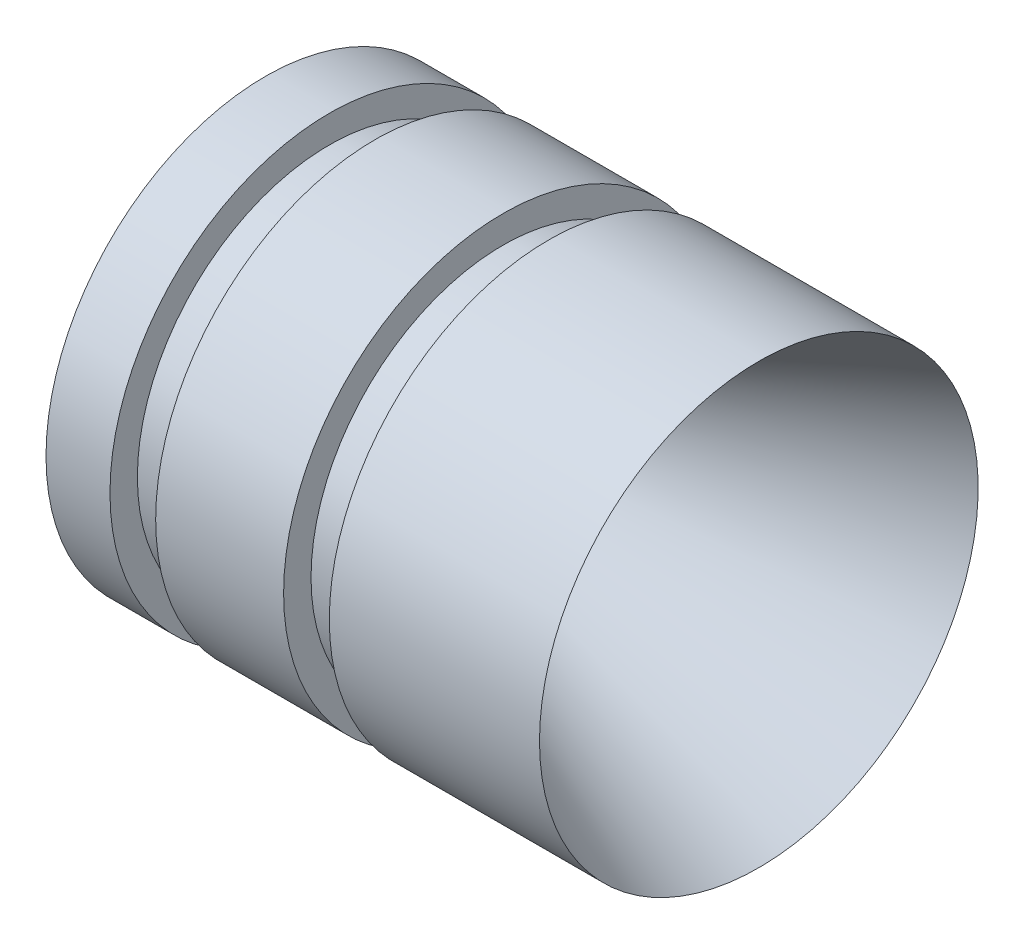
ISO-10303-21;
HEADER;
FILE_DESCRIPTION(('STEP AP214'),'2;1');
FILE_NAME('part.step','',(''),(''),'','','');
FILE_SCHEMA(('AUTOMOTIVE_DESIGN { 1 0 10303 214 1 1 1 1 }'));
ENDSEC;
DATA;
#1=APPLICATION_CONTEXT('core data for automotive mechanical design processes');
#2=APPLICATION_PROTOCOL_DEFINITION('international standard','automotive_design',2000,#1);
#3=PRODUCT_CONTEXT('',#1,'mechanical');
#4=PRODUCT('Part','Part','',(#3));
#5=PRODUCT_RELATED_PRODUCT_CATEGORY('part','',(#4));
#6=PRODUCT_DEFINITION_FORMATION('','',#4);
#7=PRODUCT_DEFINITION_CONTEXT('part definition',#1,'design');
#8=PRODUCT_DEFINITION('design','',#6,#7);
#9=PRODUCT_DEFINITION_SHAPE('','',#8);
#10=(LENGTH_UNIT() NAMED_UNIT(*) SI_UNIT(.MILLI.,.METRE.));
#11=(NAMED_UNIT(*) PLANE_ANGLE_UNIT() SI_UNIT($,.RADIAN.));
#12=(NAMED_UNIT(*) SI_UNIT($,.STERADIAN.) SOLID_ANGLE_UNIT());
#13=UNCERTAINTY_MEASURE_WITH_UNIT(LENGTH_MEASURE(1.E-05),#10,'distance_accuracy_value','');
#14=(GEOMETRIC_REPRESENTATION_CONTEXT(3) GLOBAL_UNCERTAINTY_ASSIGNED_CONTEXT((#13)) GLOBAL_UNIT_ASSIGNED_CONTEXT((#10,
#11,#12)) REPRESENTATION_CONTEXT('',''));
#15=CARTESIAN_POINT('',(0.,0.,0.));
#16=DIRECTION('',(0.,0.,1.));
#17=DIRECTION('',(1.,0.,0.));
#18=AXIS2_PLACEMENT_3D('',#15,#16,#17);
#19=CARTESIAN_POINT('',(-4.57756640170668,0.,6.01201800888769));
#20=DIRECTION('',(-1.,0.,0.));
#21=DIRECTION('',(0.,0.,1.));
#22=AXIS2_PLACEMENT_3D('',#19,#20,#21);
#23=CONICAL_SURFACE('',#22,12.,0.767218348324471);
#24=CARTESIAN_POINT('',(1.8413699147214,0.,6.01201800888769));
#25=DIRECTION('',(1.,0.,0.));
#26=DIRECTION('',(0.,0.,-1.));
#27=AXIS2_PLACEMENT_3D('',#24,#25,#26);
#28=CIRCLE('',#27,5.81031140915863);
#29=CARTESIAN_POINT('',(1.8413699147214,0.,0.201706599729064));
#30=VERTEX_POINT('',#29);
#31=EDGE_CURVE('E39',#30,#30,#28,.T.);
#32=ORIENTED_EDGE('',*,*,#31,.T.);
#33=EDGE_LOOP('',(#32));
#34=FACE_BOUND('',#33,.T.);
#35=CARTESIAN_POINT('',(-4.57756640170668,0.,6.01201800888769));
#36=DIRECTION('',(-1.,0.,0.));
#37=DIRECTION('',(0.,0.,1.));
#38=AXIS2_PLACEMENT_3D('',#35,#36,#37);
#39=CIRCLE('',#38,12.);
#40=CARTESIAN_POINT('',(-4.57756640170668,0.,18.0120180088877));
#41=VERTEX_POINT('',#40);
#42=EDGE_CURVE('E79',#41,#41,#39,.T.);
#43=ORIENTED_EDGE('',*,*,#42,.T.);
#44=EDGE_LOOP('',(#43));
#45=FACE_BOUND('',#44,.T.);
#46=ADVANCED_FACE('F32',(#34,#45),#23,.F.);
#47=CARTESIAN_POINT('',(-4.57756640170669,0.,6.01201800888769));
#48=DIRECTION('',(-1.,0.,0.));
#49=DIRECTION('',(0.,0.,1.));
#50=AXIS2_PLACEMENT_3D('',#47,#48,#49);
#51=CYLINDRICAL_SURFACE('',#50,5.25);
#52=CARTESIAN_POINT('',(3.22964105588986,0.,6.01201800888769));
#53=DIRECTION('',(1.,0.,0.));
#54=DIRECTION('',(0.,0.,-1.));
#55=AXIS2_PLACEMENT_3D('',#52,#53,#54);
#56=CIRCLE('',#55,5.25);
#57=CARTESIAN_POINT('',(3.22964105588986,0.,0.762018008887694));
#58=VERTEX_POINT('',#57);
#59=EDGE_CURVE('E43',#58,#58,#56,.F.);
#60=ORIENTED_EDGE('',*,*,#59,.T.);
#61=EDGE_LOOP('',(#60));
#62=FACE_BOUND('',#61,.T.);
#63=CARTESIAN_POINT('',(6.99316422063524,0.,6.01201800888769));
#64=DIRECTION('',(1.,0.,0.));
#65=DIRECTION('',(0.,0.,-1.));
#66=AXIS2_PLACEMENT_3D('',#63,#64,#65);
#67=CIRCLE('',#66,5.25);
#68=CARTESIAN_POINT('',(6.99316422063524,0.,0.762018008887694));
#69=VERTEX_POINT('',#68);
#70=EDGE_CURVE('E47',#69,#69,#67,.T.);
#71=ORIENTED_EDGE('',*,*,#70,.T.);
#72=EDGE_LOOP('',(#71));
#73=FACE_BOUND('',#72,.T.);
#74=ADVANCED_FACE('F141',(#62,#73),#51,.F.);
#75=CARTESIAN_POINT('',(7.42243359829331,0.,6.01201800888769));
#76=DIRECTION('',(1.,0.,0.));
#77=DIRECTION('',(0.,0.,-1.));
#78=AXIS2_PLACEMENT_3D('',#75,#76,#77);
#79=CONICAL_SURFACE('',#78,5.25,0.422853926132941);
#80=CARTESIAN_POINT('',(7.81389357529284,0.,6.01201800888769));
#81=DIRECTION('',(-1.,0.,0.));
#82=DIRECTION('',(0.,0.,1.));
#83=AXIS2_PLACEMENT_3D('',#80,#81,#82);
#84=CIRCLE('',#83,5.42615698964979);
#85=CARTESIAN_POINT('',(7.81389357529284,0.,11.4381749985375));
#86=VERTEX_POINT('',#85);
#87=EDGE_CURVE('E10',#86,#86,#84,.T.);
#88=ORIENTED_EDGE('',*,*,#87,.T.);
#89=EDGE_LOOP('',(#88));
#90=FACE_BOUND('',#89,.T.);
#91=CARTESIAN_POINT('',(22.4224335982933,0.,6.01201800888769));
#92=DIRECTION('',(-1.,0.,0.));
#93=DIRECTION('',(0.,0.,1.));
#94=AXIS2_PLACEMENT_3D('',#91,#92,#93);
#95=CIRCLE('',#94,12.);
#96=CARTESIAN_POINT('',(22.4224335982933,0.,18.0120180088877));
#97=VERTEX_POINT('',#96);
#98=EDGE_CURVE('E52',#97,#97,#95,.T.);
#99=ORIENTED_EDGE('',*,*,#98,.F.);
#100=EDGE_LOOP('',(#99));
#101=FACE_BOUND('',#100,.T.);
#102=ADVANCED_FACE('F136',(#90,#101),#79,.F.);
#103=CARTESIAN_POINT('',(-4.57756640170669,0.,6.01201800888769));
#104=DIRECTION('',(-1.,0.,0.));
#105=DIRECTION('',(0.,0.,1.));
#106=AXIS2_PLACEMENT_3D('',#103,#104,#105);
#107=CYLINDRICAL_SURFACE('',#106,12.);
#108=CARTESIAN_POINT('',(10.9224335982933,0.,6.01201800888769));
#109=DIRECTION('',(-1.,0.,0.));
#110=DIRECTION('',(0.,0.,1.));
#111=AXIS2_PLACEMENT_3D('',#108,#109,#110);
#112=CIRCLE('',#111,12.);
#113=CARTESIAN_POINT('',(10.9224335982933,0.,18.0120180088877));
#114=VERTEX_POINT('',#113);
#115=EDGE_CURVE('E55',#114,#114,#112,.T.);
#116=ORIENTED_EDGE('',*,*,#115,.F.);
#117=EDGE_LOOP('',(#116));
#118=FACE_BOUND('',#117,.T.);
#119=ORIENTED_EDGE('',*,*,#98,.T.);
#120=EDGE_LOOP('',(#119));
#121=FACE_BOUND('',#120,.T.);
#122=ADVANCED_FACE('F130',(#118,#121),#107,.T.);
#123=CARTESIAN_POINT('',(10.9224335982933,0.,-4.48798199111231));
#124=DIRECTION('',(1.,0.,0.));
#125=DIRECTION('',(0.,0.,-1.));
#126=AXIS2_PLACEMENT_3D('',#123,#124,#125);
#127=PLANE('',#126);
#128=CARTESIAN_POINT('',(10.9224335982933,0.,6.01201800888769));
#129=DIRECTION('',(-1.,0.,0.));
#130=DIRECTION('',(0.,0.,1.));
#131=AXIS2_PLACEMENT_3D('',#128,#129,#130);
#132=CIRCLE('',#131,10.5);
#133=CARTESIAN_POINT('',(10.9224335982933,0.,16.5120180088877));
#134=VERTEX_POINT('',#133);
#135=EDGE_CURVE('E58',#134,#134,#132,.T.);
#136=ORIENTED_EDGE('',*,*,#135,.F.);
#137=EDGE_LOOP('',(#136));
#138=FACE_BOUND('',#137,.T.);
#139=ORIENTED_EDGE('',*,*,#115,.T.);
#140=EDGE_LOOP('',(#139));
#141=FACE_BOUND('',#140,.T.);
#142=ADVANCED_FACE('F124',(#138,#141),#127,.F.);
#143=CARTESIAN_POINT('',(-4.57756640170669,0.,6.01201800888769));
#144=DIRECTION('',(-1.,0.,0.));
#145=DIRECTION('',(0.,0.,1.));
#146=AXIS2_PLACEMENT_3D('',#143,#144,#145);
#147=CYLINDRICAL_SURFACE('',#146,10.5);
#148=CARTESIAN_POINT('',(8.42243359829332,0.,6.01201800888769));
#149=DIRECTION('',(-1.,0.,0.));
#150=DIRECTION('',(0.,0.,1.));
#151=AXIS2_PLACEMENT_3D('',#148,#149,#150);
#152=CIRCLE('',#151,10.5);
#153=CARTESIAN_POINT('',(8.42243359829332,0.,16.5120180088877));
#154=VERTEX_POINT('',#153);
#155=EDGE_CURVE('E61',#154,#154,#152,.T.);
#156=ORIENTED_EDGE('',*,*,#155,.F.);
#157=EDGE_LOOP('',(#156));
#158=FACE_BOUND('',#157,.T.);
#159=ORIENTED_EDGE('',*,*,#135,.T.);
#160=EDGE_LOOP('',(#159));
#161=FACE_BOUND('',#160,.T.);
#162=ADVANCED_FACE('F118',(#158,#161),#147,.T.);
#163=CARTESIAN_POINT('',(8.42243359829332,0.,-5.98798199111231));
#164=DIRECTION('',(-1.,0.,0.));
#165=DIRECTION('',(0.,0.,1.));
#166=AXIS2_PLACEMENT_3D('',#163,#164,#165);
#167=PLANE('',#166);
#168=CARTESIAN_POINT('',(8.42243359829332,0.,6.01201800888769));
#169=DIRECTION('',(-1.,0.,0.));
#170=DIRECTION('',(0.,0.,1.));
#171=AXIS2_PLACEMENT_3D('',#168,#169,#170);
#172=CIRCLE('',#171,12.);
#173=CARTESIAN_POINT('',(8.42243359829332,0.,18.0120180088877));
#174=VERTEX_POINT('',#173);
#175=EDGE_CURVE('E64',#174,#174,#172,.T.);
#176=ORIENTED_EDGE('',*,*,#175,.F.);
#177=EDGE_LOOP('',(#176));
#178=FACE_BOUND('',#177,.T.);
#179=ORIENTED_EDGE('',*,*,#155,.T.);
#180=EDGE_LOOP('',(#179));
#181=FACE_BOUND('',#180,.T.);
#182=ADVANCED_FACE('F112',(#178,#181),#167,.F.);
#183=CARTESIAN_POINT('',(-4.57756640170669,0.,6.01201800888769));
#184=DIRECTION('',(-1.,0.,0.));
#185=DIRECTION('',(0.,0.,1.));
#186=AXIS2_PLACEMENT_3D('',#183,#184,#185);
#187=CYLINDRICAL_SURFACE('',#186,12.);
#188=CARTESIAN_POINT('',(1.42243359829331,0.,6.01201800888769));
#189=DIRECTION('',(-1.,0.,0.));
#190=DIRECTION('',(0.,0.,1.));
#191=AXIS2_PLACEMENT_3D('',#188,#189,#190);
#192=CIRCLE('',#191,12.);
#193=CARTESIAN_POINT('',(1.42243359829331,0.,18.0120180088877));
#194=VERTEX_POINT('',#193);
#195=EDGE_CURVE('E67',#194,#194,#192,.T.);
#196=ORIENTED_EDGE('',*,*,#195,.F.);
#197=EDGE_LOOP('',(#196));
#198=FACE_BOUND('',#197,.T.);
#199=ORIENTED_EDGE('',*,*,#175,.T.);
#200=EDGE_LOOP('',(#199));
#201=FACE_BOUND('',#200,.T.);
#202=ADVANCED_FACE('F106',(#198,#201),#187,.T.);
#203=CARTESIAN_POINT('',(1.42243359829332,0.,-4.48798199111231));
#204=DIRECTION('',(1.,0.,0.));
#205=DIRECTION('',(0.,0.,-1.));
#206=AXIS2_PLACEMENT_3D('',#203,#204,#205);
#207=PLANE('',#206);
#208=CARTESIAN_POINT('',(1.42243359829331,0.,6.01201800888769));
#209=DIRECTION('',(-1.,0.,0.));
#210=DIRECTION('',(0.,0.,1.));
#211=AXIS2_PLACEMENT_3D('',#208,#209,#210);
#212=CIRCLE('',#211,10.5);
#213=CARTESIAN_POINT('',(1.42243359829331,0.,16.5120180088877));
#214=VERTEX_POINT('',#213);
#215=EDGE_CURVE('E70',#214,#214,#212,.T.);
#216=ORIENTED_EDGE('',*,*,#215,.F.);
#217=EDGE_LOOP('',(#216));
#218=FACE_BOUND('',#217,.T.);
#219=ORIENTED_EDGE('',*,*,#195,.T.);
#220=EDGE_LOOP('',(#219));
#221=FACE_BOUND('',#220,.T.);
#222=ADVANCED_FACE('F100',(#218,#221),#207,.F.);
#223=CARTESIAN_POINT('',(-4.57756640170669,0.,6.01201800888769));
#224=DIRECTION('',(-1.,0.,0.));
#225=DIRECTION('',(0.,0.,1.));
#226=AXIS2_PLACEMENT_3D('',#223,#224,#225);
#227=CYLINDRICAL_SURFACE('',#226,10.5);
#228=CARTESIAN_POINT('',(-1.07756640170668,0.,6.01201800888769));
#229=DIRECTION('',(-1.,0.,0.));
#230=DIRECTION('',(0.,0.,1.));
#231=AXIS2_PLACEMENT_3D('',#228,#229,#230);
#232=CIRCLE('',#231,10.5);
#233=CARTESIAN_POINT('',(-1.07756640170668,0.,16.5120180088877));
#234=VERTEX_POINT('',#233);
#235=EDGE_CURVE('E73',#234,#234,#232,.T.);
#236=ORIENTED_EDGE('',*,*,#235,.F.);
#237=EDGE_LOOP('',(#236));
#238=FACE_BOUND('',#237,.T.);
#239=ORIENTED_EDGE('',*,*,#215,.T.);
#240=EDGE_LOOP('',(#239));
#241=FACE_BOUND('',#240,.T.);
#242=ADVANCED_FACE('F94',(#238,#241),#227,.T.);
#243=CARTESIAN_POINT('',(-1.07756640170669,0.,-5.98798199111231));
#244=DIRECTION('',(-1.,0.,0.));
#245=DIRECTION('',(0.,0.,1.));
#246=AXIS2_PLACEMENT_3D('',#243,#244,#245);
#247=PLANE('',#246);
#248=CARTESIAN_POINT('',(-1.07756640170669,0.,6.01201800888769));
#249=DIRECTION('',(-1.,0.,0.));
#250=DIRECTION('',(0.,0.,1.));
#251=AXIS2_PLACEMENT_3D('',#248,#249,#250);
#252=CIRCLE('',#251,12.);
#253=CARTESIAN_POINT('',(-1.07756640170669,0.,18.0120180088877));
#254=VERTEX_POINT('',#253);
#255=EDGE_CURVE('E76',#254,#254,#252,.T.);
#256=ORIENTED_EDGE('',*,*,#255,.F.);
#257=EDGE_LOOP('',(#256));
#258=FACE_BOUND('',#257,.T.);
#259=ORIENTED_EDGE('',*,*,#235,.T.);
#260=EDGE_LOOP('',(#259));
#261=FACE_BOUND('',#260,.T.);
#262=ADVANCED_FACE('F88',(#258,#261),#247,.F.);
#263=CARTESIAN_POINT('',(-4.57756640170669,0.,6.01201800888769));
#264=DIRECTION('',(-1.,0.,0.));
#265=DIRECTION('',(0.,0.,1.));
#266=AXIS2_PLACEMENT_3D('',#263,#264,#265);
#267=CYLINDRICAL_SURFACE('',#266,12.);
#268=ORIENTED_EDGE('',*,*,#42,.F.);
#269=EDGE_LOOP('',(#268));
#270=FACE_BOUND('',#269,.T.);
#271=ORIENTED_EDGE('',*,*,#255,.T.);
#272=EDGE_LOOP('',(#271));
#273=FACE_BOUND('',#272,.T.);
#274=ADVANCED_FACE('F84',(#270,#273),#267,.T.);
#275=CARTESIAN_POINT('',(3.22964105588986,0.,6.01201800888769));
#276=DIRECTION('',(1.,0.,0.));
#277=DIRECTION('',(0.,0.,-1.));
#278=AXIS2_PLACEMENT_3D('',#275,#276,#277);
#279=TOROIDAL_SURFACE('',#278,7.25,2.);
#280=ORIENTED_EDGE('',*,*,#31,.F.);
#281=EDGE_LOOP('',(#280));
#282=FACE_BOUND('',#281,.T.);
#283=ORIENTED_EDGE('',*,*,#59,.F.);
#284=EDGE_LOOP('',(#283));
#285=FACE_BOUND('',#284,.T.);
#286=ADVANCED_FACE('F87',(#282,#285),#279,.T.);
#287=CARTESIAN_POINT('',(6.99316422063524,0.,6.01201800888769));
#288=DIRECTION('',(1.,0.,0.));
#289=DIRECTION('',(0.,0.,-1.));
#290=AXIS2_PLACEMENT_3D('',#287,#288,#289);
#291=TOROIDAL_SURFACE('',#290,7.25,2.);
#292=ORIENTED_EDGE('',*,*,#70,.F.);
#293=EDGE_LOOP('',(#292));
#294=FACE_BOUND('',#293,.T.);
#295=ORIENTED_EDGE('',*,*,#87,.F.);
#296=EDGE_LOOP('',(#295));
#297=FACE_BOUND('',#296,.T.);
#298=ADVANCED_FACE('F34',(#294,#297),#291,.T.);
#299=CLOSED_SHELL('',(#46,#74,#102,#122,#142,#162,#182,#202,#222,#242,#262,#274,#286,#298));
#300=MANIFOLD_SOLID_BREP('B2',#299);
#301=ADVANCED_BREP_SHAPE_REPRESENTATION('',(#18,#300),#14);
#302=SHAPE_DEFINITION_REPRESENTATION(#9,#301);
ENDSEC;
END-ISO-10303-21;
